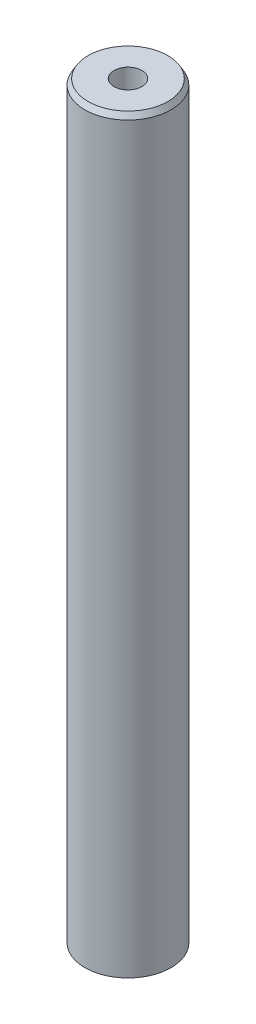
ISO-10303-21;
HEADER;
FILE_DESCRIPTION(('STEP AP214'),'2;1');
FILE_NAME('part.step','',(''),(''),'','','');
FILE_SCHEMA(('AUTOMOTIVE_DESIGN { 1 0 10303 214 1 1 1 1 }'));
ENDSEC;
DATA;
#1=APPLICATION_CONTEXT('core data for automotive mechanical design processes');
#2=APPLICATION_PROTOCOL_DEFINITION('international standard','automotive_design',2000,#1);
#3=PRODUCT_CONTEXT('',#1,'mechanical');
#4=PRODUCT('Part','Part','',(#3));
#5=PRODUCT_RELATED_PRODUCT_CATEGORY('part','',(#4));
#6=PRODUCT_DEFINITION_FORMATION('','',#4);
#7=PRODUCT_DEFINITION_CONTEXT('part definition',#1,'design');
#8=PRODUCT_DEFINITION('design','',#6,#7);
#9=PRODUCT_DEFINITION_SHAPE('','',#8);
#10=(LENGTH_UNIT() NAMED_UNIT(*) SI_UNIT(.MILLI.,.METRE.));
#11=(NAMED_UNIT(*) PLANE_ANGLE_UNIT() SI_UNIT($,.RADIAN.));
#12=(NAMED_UNIT(*) SI_UNIT($,.STERADIAN.) SOLID_ANGLE_UNIT());
#13=UNCERTAINTY_MEASURE_WITH_UNIT(LENGTH_MEASURE(1.E-05),#10,'distance_accuracy_value','');
#14=(GEOMETRIC_REPRESENTATION_CONTEXT(3) GLOBAL_UNCERTAINTY_ASSIGNED_CONTEXT((#13)) GLOBAL_UNIT_ASSIGNED_CONTEXT((#10,
#11,#12)) REPRESENTATION_CONTEXT('',''));
#15=CARTESIAN_POINT('',(0.,0.,0.));
#16=DIRECTION('',(0.,0.,1.));
#17=DIRECTION('',(1.,0.,0.));
#18=AXIS2_PLACEMENT_3D('',#15,#16,#17);
#19=CARTESIAN_POINT('',(0.,87.2701532962112,0.));
#20=DIRECTION('',(0.,-1.,0.));
#21=DIRECTION('',(0.,0.,-1.));
#22=AXIS2_PLACEMENT_3D('',#19,#20,#21);
#23=CYLINDRICAL_SURFACE('',#22,5.);
#24=CARTESIAN_POINT('',(0.,86.6241806050524,0.));
#25=DIRECTION('',(0.,1.,0.));
#26=DIRECTION('',(0.,0.,1.));
#27=AXIS2_PLACEMENT_3D('',#24,#25,#26);
#28=CIRCLE('',#27,5.);
#29=CARTESIAN_POINT('',(0.,86.6241806050524,5.));
#30=VERTEX_POINT('',#29);
#31=EDGE_CURVE('E50',#30,#30,#28,.F.);
#32=ORIENTED_EDGE('',*,*,#31,.T.);
#33=EDGE_LOOP('',(#32));
#34=FACE_BOUND('',#33,.T.);
#35=CARTESIAN_POINT('',(0.,0.372952507129723,0.));
#36=DIRECTION('',(0.,1.,0.));
#37=DIRECTION('',(0.,0.,1.));
#38=AXIS2_PLACEMENT_3D('',#35,#36,#37);
#39=CIRCLE('',#38,5.);
#40=CARTESIAN_POINT('',(0.,0.372952507129723,5.));
#41=VERTEX_POINT('',#40);
#42=EDGE_CURVE('E51',#41,#41,#39,.T.);
#43=ORIENTED_EDGE('',*,*,#42,.T.);
#44=EDGE_LOOP('',(#43));
#45=FACE_BOUND('',#44,.T.);
#46=ADVANCED_FACE('F39',(#34,#45),#23,.T.);
#47=CARTESIAN_POINT('',(0.,87.2701532962112,0.));
#48=DIRECTION('',(0.,1.,0.));
#49=DIRECTION('',(0.,0.,1.));
#50=AXIS2_PLACEMENT_3D('',#47,#48,#49);
#51=PLANE('',#50);
#52=CARTESIAN_POINT('',(0.,87.2701532962112,0.));
#53=DIRECTION('',(0.,1.,0.));
#54=DIRECTION('',(0.,0.,1.));
#55=AXIS2_PLACEMENT_3D('',#52,#53,#54);
#56=CIRCLE('',#55,4.62704749287028);
#57=CARTESIAN_POINT('',(0.,87.2701532962112,4.62704749287028));
#58=VERTEX_POINT('',#57);
#59=EDGE_CURVE('E54',#58,#58,#56,.T.);
#60=ORIENTED_EDGE('',*,*,#59,.T.);
#61=EDGE_LOOP('',(#60));
#62=FACE_BOUND('',#61,.T.);
#63=CARTESIAN_POINT('',(0.,87.2701532962112,0.));
#64=DIRECTION('',(0.,1.,0.));
#65=DIRECTION('',(0.,0.,1.));
#66=AXIS2_PLACEMENT_3D('',#63,#64,#65);
#67=CIRCLE('',#66,1.62293385946408);
#68=CARTESIAN_POINT('',(0.,87.2701532962112,1.62293385946408));
#69=VERTEX_POINT('',#68);
#70=EDGE_CURVE('E58',#69,#69,#67,.T.);
#71=ORIENTED_EDGE('',*,*,#70,.F.);
#72=EDGE_LOOP('',(#71));
#73=FACE_BOUND('',#72,.T.);
#74=ADVANCED_FACE('F69',(#62,#73),#51,.T.);
#75=CARTESIAN_POINT('',(0.,0.,0.));
#76=DIRECTION('',(0.,1.,0.));
#77=DIRECTION('',(0.,0.,1.));
#78=AXIS2_PLACEMENT_3D('',#75,#76,#77);
#79=PLANE('',#78);
#80=CARTESIAN_POINT('',(0.,0.,0.));
#81=DIRECTION('',(0.,1.,0.));
#82=DIRECTION('',(0.,0.,1.));
#83=AXIS2_PLACEMENT_3D('',#80,#81,#82);
#84=CIRCLE('',#83,4.35402730884112);
#85=CARTESIAN_POINT('',(0.,0.,4.35402730884112));
#86=VERTEX_POINT('',#85);
#87=EDGE_CURVE('E10',#86,#86,#84,.F.);
#88=ORIENTED_EDGE('',*,*,#87,.T.);
#89=EDGE_LOOP('',(#88));
#90=FACE_BOUND('',#89,.T.);
#91=CARTESIAN_POINT('',(0.,0.,0.));
#92=DIRECTION('',(0.,1.,0.));
#93=DIRECTION('',(0.,0.,1.));
#94=AXIS2_PLACEMENT_3D('',#91,#92,#93);
#95=CIRCLE('',#94,1.62293385946408);
#96=CARTESIAN_POINT('',(0.,0.,1.62293385946408));
#97=VERTEX_POINT('',#96);
#98=EDGE_CURVE('E63',#97,#97,#95,.T.);
#99=ORIENTED_EDGE('',*,*,#98,.T.);
#100=EDGE_LOOP('',(#99));
#101=FACE_BOUND('',#100,.T.);
#102=ADVANCED_FACE('F75',(#90,#101),#79,.F.);
#103=CARTESIAN_POINT('',(0.,87.2701532962112,0.));
#104=DIRECTION('',(0.,-1.,0.));
#105=DIRECTION('',(0.,0.,-1.));
#106=AXIS2_PLACEMENT_3D('',#103,#104,#105);
#107=CYLINDRICAL_SURFACE('',#106,1.62293385946408);
#108=ORIENTED_EDGE('',*,*,#70,.T.);
#109=EDGE_LOOP('',(#108));
#110=FACE_BOUND('',#109,.T.);
#111=ORIENTED_EDGE('',*,*,#98,.F.);
#112=EDGE_LOOP('',(#111));
#113=FACE_BOUND('',#112,.T.);
#114=ADVANCED_FACE('F70',(#110,#113),#107,.F.);
#115=CARTESIAN_POINT('',(0.,87.2701532962112,0.));
#116=DIRECTION('',(0.,-1.,0.));
#117=DIRECTION('',(0.,0.,-1.));
#118=AXIS2_PLACEMENT_3D('',#115,#116,#117);
#119=CONICAL_SURFACE('',#118,4.62704749287028,0.523598775598293);
#120=ORIENTED_EDGE('',*,*,#31,.F.);
#121=EDGE_LOOP('',(#120));
#122=FACE_BOUND('',#121,.T.);
#123=ORIENTED_EDGE('',*,*,#59,.F.);
#124=EDGE_LOOP('',(#123));
#125=FACE_BOUND('',#124,.T.);
#126=ADVANCED_FACE('F81',(#122,#125),#119,.T.);
#127=CARTESIAN_POINT('',(0.,0.372952507129723,0.));
#128=DIRECTION('',(0.,1.,0.));
#129=DIRECTION('',(0.,0.,1.));
#130=AXIS2_PLACEMENT_3D('',#127,#128,#129);
#131=CONICAL_SURFACE('',#130,5.,1.0471975511966);
#132=ORIENTED_EDGE('',*,*,#87,.F.);
#133=EDGE_LOOP('',(#132));
#134=FACE_BOUND('',#133,.T.);
#135=ORIENTED_EDGE('',*,*,#42,.F.);
#136=EDGE_LOOP('',(#135));
#137=FACE_BOUND('',#136,.T.);
#138=ADVANCED_FACE('F45',(#134,#137),#131,.T.);
#139=CLOSED_SHELL('',(#46,#74,#102,#114,#126,#138));
#140=MANIFOLD_SOLID_BREP('B2',#139);
#141=ADVANCED_BREP_SHAPE_REPRESENTATION('',(#18,#140),#14);
#142=SHAPE_DEFINITION_REPRESENTATION(#9,#141);
ENDSEC;
END-ISO-10303-21;
